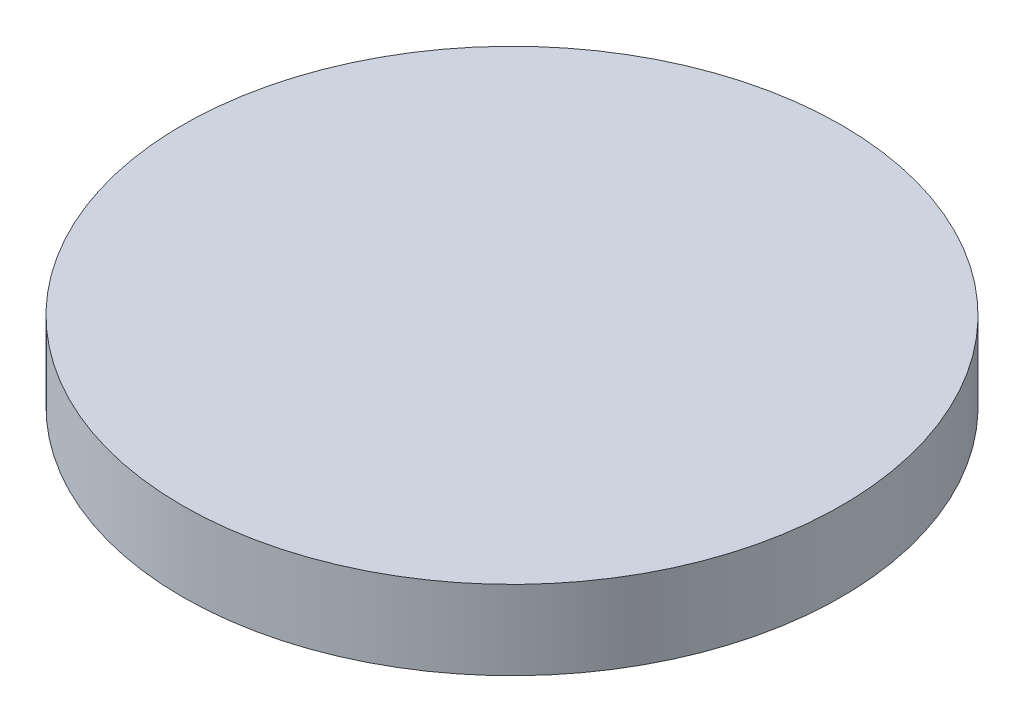
ISO-10303-21;
HEADER;
FILE_DESCRIPTION(('STEP AP214'),'2;1');
FILE_NAME('part.step','',(''),(''),'','','');
FILE_SCHEMA(('AUTOMOTIVE_DESIGN { 1 0 10303 214 1 1 1 1 }'));
ENDSEC;
DATA;
#1=APPLICATION_CONTEXT('core data for automotive mechanical design processes');
#2=APPLICATION_PROTOCOL_DEFINITION('international standard','automotive_design',2000,#1);
#3=PRODUCT_CONTEXT('',#1,'mechanical');
#4=PRODUCT('Part','Part','',(#3));
#5=PRODUCT_RELATED_PRODUCT_CATEGORY('part','',(#4));
#6=PRODUCT_DEFINITION_FORMATION('','',#4);
#7=PRODUCT_DEFINITION_CONTEXT('part definition',#1,'design');
#8=PRODUCT_DEFINITION('design','',#6,#7);
#9=PRODUCT_DEFINITION_SHAPE('','',#8);
#10=(LENGTH_UNIT() NAMED_UNIT(*) SI_UNIT(.MILLI.,.METRE.));
#11=(NAMED_UNIT(*) PLANE_ANGLE_UNIT() SI_UNIT($,.RADIAN.));
#12=(NAMED_UNIT(*) SI_UNIT($,.STERADIAN.) SOLID_ANGLE_UNIT());
#13=UNCERTAINTY_MEASURE_WITH_UNIT(LENGTH_MEASURE(1.E-05),#10,'distance_accuracy_value','');
#14=(GEOMETRIC_REPRESENTATION_CONTEXT(3) GLOBAL_UNCERTAINTY_ASSIGNED_CONTEXT((#13)) GLOBAL_UNIT_ASSIGNED_CONTEXT((#10,
#11,#12)) REPRESENTATION_CONTEXT('',''));
#15=CARTESIAN_POINT('',(0.,0.,0.));
#16=DIRECTION('',(0.,0.,1.));
#17=DIRECTION('',(1.,0.,0.));
#18=AXIS2_PLACEMENT_3D('',#15,#16,#17);
#19=CARTESIAN_POINT('',(0.,15.24,0.));
#20=DIRECTION('',(0.,-1.,0.));
#21=DIRECTION('',(0.,0.,-1.));
#22=AXIS2_PLACEMENT_3D('',#19,#20,#21);
#23=CYLINDRICAL_SURFACE('',#22,63.5);
#24=CARTESIAN_POINT('',(0.,15.24,0.));
#25=DIRECTION('',(0.,1.,0.));
#26=DIRECTION('',(0.,0.,1.));
#27=AXIS2_PLACEMENT_3D('',#24,#25,#26);
#28=CIRCLE('',#27,63.5);
#29=CARTESIAN_POINT('',(0.,15.24,63.5));
#30=VERTEX_POINT('',#29);
#31=EDGE_CURVE('E10',#30,#30,#28,.T.);
#32=ORIENTED_EDGE('',*,*,#31,.F.);
#33=EDGE_LOOP('',(#32));
#34=FACE_BOUND('',#33,.T.);
#35=CARTESIAN_POINT('',(0.,0.,0.));
#36=DIRECTION('',(0.,1.,0.));
#37=DIRECTION('',(0.,0.,1.));
#38=AXIS2_PLACEMENT_3D('',#35,#36,#37);
#39=CIRCLE('',#38,63.5);
#40=CARTESIAN_POINT('',(0.,0.,63.5));
#41=VERTEX_POINT('',#40);
#42=EDGE_CURVE('E38',#41,#41,#39,.T.);
#43=ORIENTED_EDGE('',*,*,#42,.T.);
#44=EDGE_LOOP('',(#43));
#45=FACE_BOUND('',#44,.T.);
#46=ADVANCED_FACE('F35',(#34,#45),#23,.T.);
#47=CARTESIAN_POINT('',(0.,15.24,0.));
#48=DIRECTION('',(0.,1.,0.));
#49=DIRECTION('',(0.,0.,1.));
#50=AXIS2_PLACEMENT_3D('',#47,#48,#49);
#51=PLANE('',#50);
#52=ORIENTED_EDGE('',*,*,#31,.T.);
#53=EDGE_LOOP('',(#52));
#54=FACE_BOUND('',#53,.T.);
#55=ADVANCED_FACE('F50',(#54),#51,.T.);
#56=CARTESIAN_POINT('',(0.,0.,0.));
#57=DIRECTION('',(0.,1.,0.));
#58=DIRECTION('',(0.,0.,1.));
#59=AXIS2_PLACEMENT_3D('',#56,#57,#58);
#60=PLANE('',#59);
#61=ORIENTED_EDGE('',*,*,#42,.F.);
#62=EDGE_LOOP('',(#61));
#63=FACE_BOUND('',#62,.T.);
#64=ADVANCED_FACE('F48',(#63),#60,.F.);
#65=CLOSED_SHELL('',(#46,#55,#64));
#66=MANIFOLD_SOLID_BREP('B2',#65);
#67=ADVANCED_BREP_SHAPE_REPRESENTATION('',(#18,#66),#14);
#68=SHAPE_DEFINITION_REPRESENTATION(#9,#67);
ENDSEC;
END-ISO-10303-21;
